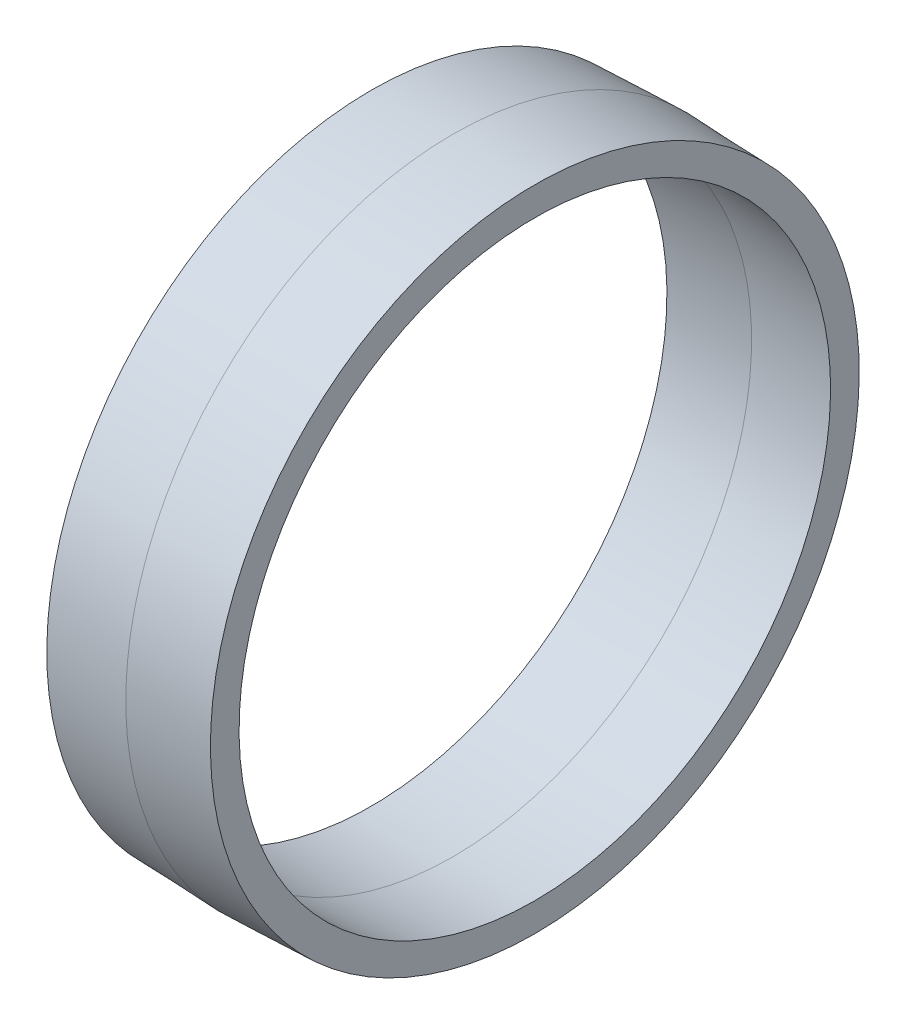
ISO-10303-21;
HEADER;
FILE_DESCRIPTION(('STEP AP214'),'2;1');
FILE_NAME('part.step','',(''),(''),'','','');
FILE_SCHEMA(('AUTOMOTIVE_DESIGN { 1 0 10303 214 1 1 1 1 }'));
ENDSEC;
DATA;
#1=APPLICATION_CONTEXT('core data for automotive mechanical design processes');
#2=APPLICATION_PROTOCOL_DEFINITION('international standard','automotive_design',2000,#1);
#3=PRODUCT_CONTEXT('',#1,'mechanical');
#4=PRODUCT('Part','Part','',(#3));
#5=PRODUCT_RELATED_PRODUCT_CATEGORY('part','',(#4));
#6=PRODUCT_DEFINITION_FORMATION('','',#4);
#7=PRODUCT_DEFINITION_CONTEXT('part definition',#1,'design');
#8=PRODUCT_DEFINITION('design','',#6,#7);
#9=PRODUCT_DEFINITION_SHAPE('','',#8);
#10=(LENGTH_UNIT() NAMED_UNIT(*) SI_UNIT(.MILLI.,.METRE.));
#11=(NAMED_UNIT(*) PLANE_ANGLE_UNIT() SI_UNIT($,.RADIAN.));
#12=(NAMED_UNIT(*) SI_UNIT($,.STERADIAN.) SOLID_ANGLE_UNIT());
#13=UNCERTAINTY_MEASURE_WITH_UNIT(LENGTH_MEASURE(1.E-05),#10,'distance_accuracy_value','');
#14=(GEOMETRIC_REPRESENTATION_CONTEXT(3) GLOBAL_UNCERTAINTY_ASSIGNED_CONTEXT((#13)) GLOBAL_UNIT_ASSIGNED_CONTEXT((#10,
#11,#12)) REPRESENTATION_CONTEXT('',''));
#15=CARTESIAN_POINT('',(0.,0.,0.));
#16=DIRECTION('',(0.,0.,1.));
#17=DIRECTION('',(1.,0.,0.));
#18=AXIS2_PLACEMENT_3D('',#15,#16,#17);
#19=CARTESIAN_POINT('',(-1.22406624605667,0.,0.));
#20=DIRECTION('',(1.,0.,0.));
#21=DIRECTION('',(0.,1.,0.));
#22=AXIS2_PLACEMENT_3D('',#19,#20,#21);
#23=CONICAL_SURFACE('',#22,46.355,0.0349065850398794);
#24=CARTESIAN_POINT('',(-1.22406624605675,0.,0.));
#25=DIRECTION('',(-1.,0.,0.));
#26=DIRECTION('',(0.,-1.,0.));
#27=AXIS2_PLACEMENT_3D('',#24,#25,#26);
#28=CIRCLE('',#27,46.355);
#29=CARTESIAN_POINT('',(-1.22406624605684,-46.355,0.));
#30=VERTEX_POINT('',#29);
#31=EDGE_CURVE('E30',#30,#30,#28,.F.);
#32=ORIENTED_EDGE('',*,*,#31,.T.);
#33=EDGE_LOOP('',(#32));
#34=FACE_BOUND('',#33,.T.);
#35=CARTESIAN_POINT('',(-13.9240662460567,0.,0.));
#36=DIRECTION('',(1.,0.,0.));
#37=DIRECTION('',(0.,1.,0.));
#38=AXIS2_PLACEMENT_3D('',#35,#36,#37);
#39=CIRCLE('',#38,45.9115062274549);
#40=CARTESIAN_POINT('',(-13.9240662460567,45.9115062274549,0.));
#41=VERTEX_POINT('',#40);
#42=EDGE_CURVE('E18',#41,#41,#39,.F.);
#43=ORIENTED_EDGE('',*,*,#42,.T.);
#44=EDGE_LOOP('',(#43));
#45=FACE_BOUND('',#44,.T.);
#46=ADVANCED_FACE('F15',(#34,#45),#23,.F.);
#47=CARTESIAN_POINT('',(-1.22406624605684,0.,0.));
#48=DIRECTION('',(-1.,0.,0.));
#49=DIRECTION('',(0.,-1.,0.));
#50=AXIS2_PLACEMENT_3D('',#47,#48,#49);
#51=CONICAL_SURFACE('',#50,46.355,0.0349065850398788);
#52=CARTESIAN_POINT('',(11.4759337539432,0.,0.));
#53=DIRECTION('',(-1.,0.,0.));
#54=DIRECTION('',(0.,-1.,0.));
#55=AXIS2_PLACEMENT_3D('',#52,#53,#54);
#56=CIRCLE('',#55,45.9115062274549);
#57=CARTESIAN_POINT('',(11.4759337539432,-45.9115062274549,0.));
#58=VERTEX_POINT('',#57);
#59=EDGE_CURVE('E34',#58,#58,#56,.F.);
#60=ORIENTED_EDGE('',*,*,#59,.T.);
#61=EDGE_LOOP('',(#60));
#62=FACE_BOUND('',#61,.T.);
#63=ORIENTED_EDGE('',*,*,#31,.F.);
#64=EDGE_LOOP('',(#63));
#65=FACE_BOUND('',#64,.T.);
#66=ADVANCED_FACE('F45',(#62,#65),#51,.F.);
#67=CARTESIAN_POINT('',(-13.9240662460568,45.9115062274549,0.));
#68=DIRECTION('',(1.,0.,0.));
#69=DIRECTION('',(0.,1.,0.));
#70=AXIS2_PLACEMENT_3D('',#67,#68,#69);
#71=PLANE('',#70);
#72=CARTESIAN_POINT('',(-13.9240662460567,0.,0.));
#73=DIRECTION('',(1.,0.,0.));
#74=DIRECTION('',(0.,1.,0.));
#75=AXIS2_PLACEMENT_3D('',#72,#73,#74);
#76=CIRCLE('',#75,50.3565062274549);
#77=CARTESIAN_POINT('',(-13.9240662460567,50.3565062274549,0.));
#78=VERTEX_POINT('',#77);
#79=EDGE_CURVE('E27',#78,#78,#76,.T.);
#80=ORIENTED_EDGE('',*,*,#79,.F.);
#81=EDGE_LOOP('',(#80));
#82=FACE_BOUND('',#81,.T.);
#83=ORIENTED_EDGE('',*,*,#42,.F.);
#84=EDGE_LOOP('',(#83));
#85=FACE_BOUND('',#84,.T.);
#86=ADVANCED_FACE('F42',(#82,#85),#71,.F.);
#87=CARTESIAN_POINT('',(11.4759337539432,50.3565062274549,0.));
#88=DIRECTION('',(-1.,0.,0.));
#89=DIRECTION('',(0.,-1.,0.));
#90=AXIS2_PLACEMENT_3D('',#87,#88,#89);
#91=PLANE('',#90);
#92=ORIENTED_EDGE('',*,*,#59,.F.);
#93=EDGE_LOOP('',(#92));
#94=FACE_BOUND('',#93,.T.);
#95=CARTESIAN_POINT('',(11.4759337539432,0.,0.));
#96=DIRECTION('',(-1.,0.,0.));
#97=DIRECTION('',(0.,-1.,0.));
#98=AXIS2_PLACEMENT_3D('',#95,#96,#97);
#99=CIRCLE('',#98,50.3565062274549);
#100=CARTESIAN_POINT('',(11.4759337539432,-50.3565062274549,0.));
#101=VERTEX_POINT('',#100);
#102=EDGE_CURVE('E22',#101,#101,#99,.T.);
#103=ORIENTED_EDGE('',*,*,#102,.F.);
#104=EDGE_LOOP('',(#103));
#105=FACE_BOUND('',#104,.T.);
#106=ADVANCED_FACE('F44',(#94,#105),#91,.F.);
#107=CARTESIAN_POINT('',(-1.22406624605671,0.,0.));
#108=DIRECTION('',(1.,0.,0.));
#109=DIRECTION('',(0.,1.,0.));
#110=AXIS2_PLACEMENT_3D('',#107,#108,#109);
#111=CONICAL_SURFACE('',#110,50.8,0.0349065850398795);
#112=CARTESIAN_POINT('',(-1.22406624605675,0.,0.));
#113=DIRECTION('',(-1.,0.,0.));
#114=DIRECTION('',(0.,-1.,0.));
#115=AXIS2_PLACEMENT_3D('',#112,#113,#114);
#116=CIRCLE('',#115,50.8);
#117=CARTESIAN_POINT('',(-1.2240662460568,-50.8,0.));
#118=VERTEX_POINT('',#117);
#119=EDGE_CURVE('E10',#118,#118,#116,.F.);
#120=ORIENTED_EDGE('',*,*,#119,.F.);
#121=EDGE_LOOP('',(#120));
#122=FACE_BOUND('',#121,.T.);
#123=ORIENTED_EDGE('',*,*,#79,.T.);
#124=EDGE_LOOP('',(#123));
#125=FACE_BOUND('',#124,.T.);
#126=ADVANCED_FACE('F53',(#122,#125),#111,.T.);
#127=CARTESIAN_POINT('',(-1.2240662460568,0.,0.));
#128=DIRECTION('',(-1.,0.,0.));
#129=DIRECTION('',(0.,-1.,0.));
#130=AXIS2_PLACEMENT_3D('',#127,#128,#129);
#131=CONICAL_SURFACE('',#130,50.8,0.0349065850398782);
#132=ORIENTED_EDGE('',*,*,#119,.T.);
#133=EDGE_LOOP('',(#132));
#134=FACE_BOUND('',#133,.T.);
#135=ORIENTED_EDGE('',*,*,#102,.T.);
#136=EDGE_LOOP('',(#135));
#137=FACE_BOUND('',#136,.T.);
#138=ADVANCED_FACE('F57',(#134,#137),#131,.T.);
#139=CLOSED_SHELL('',(#46,#66,#86,#106,#126,#138));
#140=MANIFOLD_SOLID_BREP('B1',#139);
#141=ADVANCED_BREP_SHAPE_REPRESENTATION('',(#18,#140),#14);
#142=SHAPE_DEFINITION_REPRESENTATION(#9,#141);
ENDSEC;
END-ISO-10303-21;
